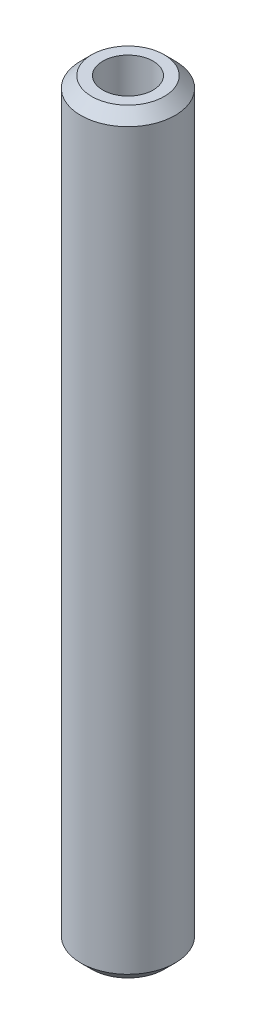
ISO-10303-21;
HEADER;
FILE_DESCRIPTION(('STEP AP214'),'2;1');
FILE_NAME('part.step','',(''),(''),'','','');
FILE_SCHEMA(('AUTOMOTIVE_DESIGN { 1 0 10303 214 1 1 1 1 }'));
ENDSEC;
DATA;
#1=APPLICATION_CONTEXT('core data for automotive mechanical design processes');
#2=APPLICATION_PROTOCOL_DEFINITION('international standard','automotive_design',2000,#1);
#3=PRODUCT_CONTEXT('',#1,'mechanical');
#4=PRODUCT('Part','Part','',(#3));
#5=PRODUCT_RELATED_PRODUCT_CATEGORY('part','',(#4));
#6=PRODUCT_DEFINITION_FORMATION('','',#4);
#7=PRODUCT_DEFINITION_CONTEXT('part definition',#1,'design');
#8=PRODUCT_DEFINITION('design','',#6,#7);
#9=PRODUCT_DEFINITION_SHAPE('','',#8);
#10=(LENGTH_UNIT() NAMED_UNIT(*) SI_UNIT(.MILLI.,.METRE.));
#11=(NAMED_UNIT(*) PLANE_ANGLE_UNIT() SI_UNIT($,.RADIAN.));
#12=(NAMED_UNIT(*) SI_UNIT($,.STERADIAN.) SOLID_ANGLE_UNIT());
#13=UNCERTAINTY_MEASURE_WITH_UNIT(LENGTH_MEASURE(1.E-05),#10,'distance_accuracy_value','');
#14=(GEOMETRIC_REPRESENTATION_CONTEXT(3) GLOBAL_UNCERTAINTY_ASSIGNED_CONTEXT((#13)) GLOBAL_UNIT_ASSIGNED_CONTEXT((#10,
#11,#12)) REPRESENTATION_CONTEXT('',''));
#15=CARTESIAN_POINT('',(0.,0.,0.));
#16=DIRECTION('',(0.,0.,1.));
#17=DIRECTION('',(1.,0.,0.));
#18=AXIS2_PLACEMENT_3D('',#15,#16,#17);
#19=CARTESIAN_POINT('',(0.,80.1343544020666,0.));
#20=DIRECTION('',(0.,-1.,0.));
#21=DIRECTION('',(0.,0.,-1.));
#22=AXIS2_PLACEMENT_3D('',#19,#20,#21);
#23=CYLINDRICAL_SURFACE('',#22,5.);
#24=CARTESIAN_POINT('',(0.,78.9756153791699,0.));
#25=DIRECTION('',(0.,1.,0.));
#26=DIRECTION('',(0.,0.,1.));
#27=AXIS2_PLACEMENT_3D('',#24,#25,#26);
#28=CIRCLE('',#27,5.);
#29=CARTESIAN_POINT('',(0.,78.9756153791699,5.));
#30=VERTEX_POINT('',#29);
#31=EDGE_CURVE('E50',#30,#30,#28,.F.);
#32=ORIENTED_EDGE('',*,*,#31,.T.);
#33=EDGE_LOOP('',(#32));
#34=FACE_BOUND('',#33,.T.);
#35=CARTESIAN_POINT('',(0.,1.1587390228967,0.));
#36=DIRECTION('',(0.,1.,0.));
#37=DIRECTION('',(0.,0.,1.));
#38=AXIS2_PLACEMENT_3D('',#35,#36,#37);
#39=CIRCLE('',#38,5.);
#40=CARTESIAN_POINT('',(0.,1.1587390228967,5.));
#41=VERTEX_POINT('',#40);
#42=EDGE_CURVE('E51',#41,#41,#39,.T.);
#43=ORIENTED_EDGE('',*,*,#42,.T.);
#44=EDGE_LOOP('',(#43));
#45=FACE_BOUND('',#44,.T.);
#46=ADVANCED_FACE('F39',(#34,#45),#23,.T.);
#47=CARTESIAN_POINT('',(0.,80.1343544020666,0.));
#48=DIRECTION('',(0.,1.,0.));
#49=DIRECTION('',(0.,0.,1.));
#50=AXIS2_PLACEMENT_3D('',#47,#48,#49);
#51=PLANE('',#50);
#52=CARTESIAN_POINT('',(0.,80.1343544020666,0.));
#53=DIRECTION('',(0.,1.,0.));
#54=DIRECTION('',(0.,0.,1.));
#55=AXIS2_PLACEMENT_3D('',#52,#53,#54);
#56=CIRCLE('',#55,3.84126097710331);
#57=CARTESIAN_POINT('',(0.,80.1343544020666,3.84126097710331));
#58=VERTEX_POINT('',#57);
#59=EDGE_CURVE('E54',#58,#58,#56,.T.);
#60=ORIENTED_EDGE('',*,*,#59,.T.);
#61=EDGE_LOOP('',(#60));
#62=FACE_BOUND('',#61,.T.);
#63=CARTESIAN_POINT('',(0.,80.1343544020666,0.));
#64=DIRECTION('',(0.,1.,0.));
#65=DIRECTION('',(0.,0.,1.));
#66=AXIS2_PLACEMENT_3D('',#63,#64,#65);
#67=CIRCLE('',#66,2.66497492821491);
#68=CARTESIAN_POINT('',(0.,80.1343544020666,2.66497492821491));
#69=VERTEX_POINT('',#68);
#70=EDGE_CURVE('E58',#69,#69,#67,.T.);
#71=ORIENTED_EDGE('',*,*,#70,.F.);
#72=EDGE_LOOP('',(#71));
#73=FACE_BOUND('',#72,.T.);
#74=ADVANCED_FACE('F69',(#62,#73),#51,.T.);
#75=CARTESIAN_POINT('',(0.,0.,0.));
#76=DIRECTION('',(0.,1.,0.));
#77=DIRECTION('',(0.,0.,1.));
#78=AXIS2_PLACEMENT_3D('',#75,#76,#77);
#79=PLANE('',#78);
#80=CARTESIAN_POINT('',(0.,0.,0.));
#81=DIRECTION('',(0.,1.,0.));
#82=DIRECTION('',(0.,0.,1.));
#83=AXIS2_PLACEMENT_3D('',#80,#81,#82);
#84=CIRCLE('',#83,3.84126097710329);
#85=CARTESIAN_POINT('',(0.,0.,3.84126097710329));
#86=VERTEX_POINT('',#85);
#87=EDGE_CURVE('E10',#86,#86,#84,.F.);
#88=ORIENTED_EDGE('',*,*,#87,.T.);
#89=EDGE_LOOP('',(#88));
#90=FACE_BOUND('',#89,.T.);
#91=CARTESIAN_POINT('',(0.,0.,0.));
#92=DIRECTION('',(0.,1.,0.));
#93=DIRECTION('',(0.,0.,1.));
#94=AXIS2_PLACEMENT_3D('',#91,#92,#93);
#95=CIRCLE('',#94,2.66497492821491);
#96=CARTESIAN_POINT('',(0.,0.,2.66497492821491));
#97=VERTEX_POINT('',#96);
#98=EDGE_CURVE('E63',#97,#97,#95,.T.);
#99=ORIENTED_EDGE('',*,*,#98,.T.);
#100=EDGE_LOOP('',(#99));
#101=FACE_BOUND('',#100,.T.);
#102=ADVANCED_FACE('F75',(#90,#101),#79,.F.);
#103=CARTESIAN_POINT('',(0.,80.1343544020666,0.));
#104=DIRECTION('',(0.,-1.,0.));
#105=DIRECTION('',(0.,0.,-1.));
#106=AXIS2_PLACEMENT_3D('',#103,#104,#105);
#107=CYLINDRICAL_SURFACE('',#106,2.66497492821491);
#108=ORIENTED_EDGE('',*,*,#70,.T.);
#109=EDGE_LOOP('',(#108));
#110=FACE_BOUND('',#109,.T.);
#111=ORIENTED_EDGE('',*,*,#98,.F.);
#112=EDGE_LOOP('',(#111));
#113=FACE_BOUND('',#112,.T.);
#114=ADVANCED_FACE('F70',(#110,#113),#107,.F.);
#115=CARTESIAN_POINT('',(0.,80.1343544020666,0.));
#116=DIRECTION('',(0.,-1.,0.));
#117=DIRECTION('',(0.,0.,-1.));
#118=AXIS2_PLACEMENT_3D('',#115,#116,#117);
#119=CONICAL_SURFACE('',#118,3.84126097710331,0.785398163397455);
#120=ORIENTED_EDGE('',*,*,#31,.F.);
#121=EDGE_LOOP('',(#120));
#122=FACE_BOUND('',#121,.T.);
#123=ORIENTED_EDGE('',*,*,#59,.F.);
#124=EDGE_LOOP('',(#123));
#125=FACE_BOUND('',#124,.T.);
#126=ADVANCED_FACE('F81',(#122,#125),#119,.T.);
#127=CARTESIAN_POINT('',(0.,1.1587390228967,0.));
#128=DIRECTION('',(0.,1.,0.));
#129=DIRECTION('',(0.,0.,1.));
#130=AXIS2_PLACEMENT_3D('',#127,#128,#129);
#131=CONICAL_SURFACE('',#130,5.,0.785398163397452);
#132=ORIENTED_EDGE('',*,*,#87,.F.);
#133=EDGE_LOOP('',(#132));
#134=FACE_BOUND('',#133,.T.);
#135=ORIENTED_EDGE('',*,*,#42,.F.);
#136=EDGE_LOOP('',(#135));
#137=FACE_BOUND('',#136,.T.);
#138=ADVANCED_FACE('F45',(#134,#137),#131,.T.);
#139=CLOSED_SHELL('',(#46,#74,#102,#114,#126,#138));
#140=MANIFOLD_SOLID_BREP('B2',#139);
#141=ADVANCED_BREP_SHAPE_REPRESENTATION('',(#18,#140),#14);
#142=SHAPE_DEFINITION_REPRESENTATION(#9,#141);
ENDSEC;
END-ISO-10303-21;
